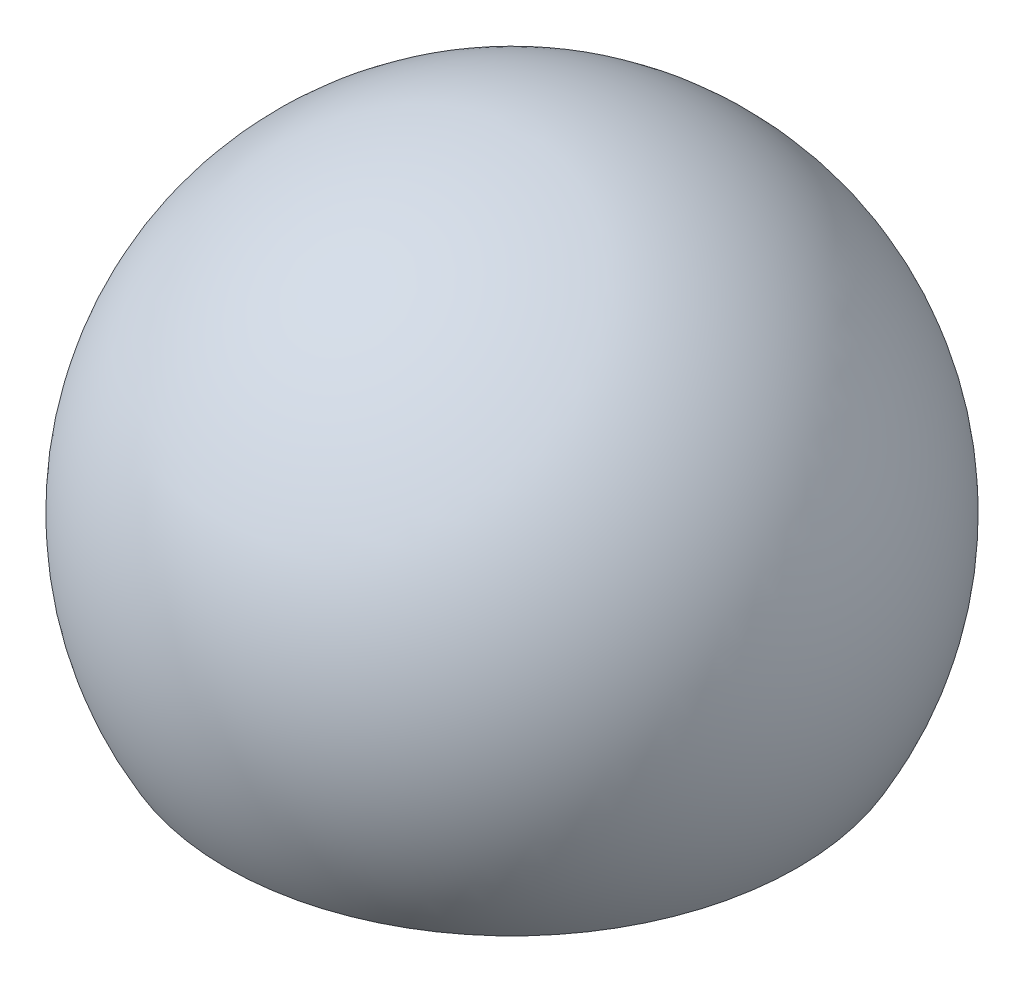
ISO-10303-21;
HEADER;
FILE_DESCRIPTION(('STEP AP214'),'2;1');
FILE_NAME('part.step','',(''),(''),'','','');
FILE_SCHEMA(('AUTOMOTIVE_DESIGN { 1 0 10303 214 1 1 1 1 }'));
ENDSEC;
DATA;
#1=APPLICATION_CONTEXT('core data for automotive mechanical design processes');
#2=APPLICATION_PROTOCOL_DEFINITION('international standard','automotive_design',2000,#1);
#3=PRODUCT_CONTEXT('',#1,'mechanical');
#4=PRODUCT('Part','Part','',(#3));
#5=PRODUCT_RELATED_PRODUCT_CATEGORY('part','',(#4));
#6=PRODUCT_DEFINITION_FORMATION('','',#4);
#7=PRODUCT_DEFINITION_CONTEXT('part definition',#1,'design');
#8=PRODUCT_DEFINITION('design','',#6,#7);
#9=PRODUCT_DEFINITION_SHAPE('','',#8);
#10=(LENGTH_UNIT() NAMED_UNIT(*) SI_UNIT(.MILLI.,.METRE.));
#11=(NAMED_UNIT(*) PLANE_ANGLE_UNIT() SI_UNIT($,.RADIAN.));
#12=(NAMED_UNIT(*) SI_UNIT($,.STERADIAN.) SOLID_ANGLE_UNIT());
#13=UNCERTAINTY_MEASURE_WITH_UNIT(LENGTH_MEASURE(1.E-05),#10,'distance_accuracy_value','');
#14=(GEOMETRIC_REPRESENTATION_CONTEXT(3) GLOBAL_UNCERTAINTY_ASSIGNED_CONTEXT((#13)) GLOBAL_UNIT_ASSIGNED_CONTEXT((#10,
#11,#12)) REPRESENTATION_CONTEXT('',''));
#15=CARTESIAN_POINT('',(0.,0.,0.));
#16=DIRECTION('',(0.,0.,1.));
#17=DIRECTION('',(1.,0.,0.));
#18=AXIS2_PLACEMENT_3D('',#15,#16,#17);
#19=CARTESIAN_POINT('',(0.,0.,0.));
#20=DIRECTION('',(0.,1.,0.));
#21=DIRECTION('',(1.,0.,0.));
#22=AXIS2_PLACEMENT_3D('',#19,#20,#21);
#23=SPHERICAL_SURFACE('',#22,12.7);
#24=CARTESIAN_POINT('',(0.,-6.35,0.));
#25=DIRECTION('',(0.,1.,0.));
#26=DIRECTION('',(0.,0.,1.));
#27=AXIS2_PLACEMENT_3D('',#24,#25,#26);
#28=CIRCLE('',#27,10.9985226280624);
#29=CARTESIAN_POINT('',(0.,-6.35,10.9985226280624));
#30=VERTEX_POINT('',#29);
#31=EDGE_CURVE('E12',#30,#30,#28,.T.);
#32=ORIENTED_EDGE('',*,*,#31,.T.);
#33=EDGE_LOOP('',(#32));
#34=FACE_BOUND('',#33,.T.);
#35=ADVANCED_FACE('F42',(#34),#23,.T.);
#36=CARTESIAN_POINT('',(-10.9985226280624,-6.35,-12.7));
#37=DIRECTION('',(0.,1.,0.));
#38=DIRECTION('',(0.,0.,1.));
#39=AXIS2_PLACEMENT_3D('',#36,#37,#38);
#40=PLANE('',#39);
#41=CARTESIAN_POINT('',(0.,-6.35,0.));
#42=DIRECTION('',(0.,-1.,0.));
#43=DIRECTION('',(0.,0.,-1.));
#44=AXIS2_PLACEMENT_3D('',#41,#42,#43);
#45=CIRCLE('',#44,8.4582);
#46=CARTESIAN_POINT('',(0.,-6.35,-8.4582));
#47=VERTEX_POINT('',#46);
#48=EDGE_CURVE('E52',#47,#47,#45,.T.);
#49=ORIENTED_EDGE('',*,*,#48,.F.);
#50=EDGE_LOOP('',(#49));
#51=FACE_BOUND('',#50,.T.);
#52=ORIENTED_EDGE('',*,*,#31,.F.);
#53=EDGE_LOOP('',(#52));
#54=FACE_BOUND('',#53,.T.);
#55=ADVANCED_FACE('F61',(#51,#54),#40,.F.);
#56=CARTESIAN_POINT('',(0.,-6.223,0.));
#57=DIRECTION('',(0.,-1.,0.));
#58=DIRECTION('',(0.,0.,-1.));
#59=AXIS2_PLACEMENT_3D('',#56,#57,#58);
#60=CYLINDRICAL_SURFACE('',#59,8.4582);
#61=CARTESIAN_POINT('',(0.,-6.223,0.));
#62=DIRECTION('',(0.,-1.,0.));
#63=DIRECTION('',(0.,0.,-1.));
#64=AXIS2_PLACEMENT_3D('',#61,#62,#63);
#65=CIRCLE('',#64,8.4582);
#66=CARTESIAN_POINT('',(0.,-6.223,-8.4582));
#67=VERTEX_POINT('',#66);
#68=EDGE_CURVE('E48',#67,#67,#65,.T.);
#69=ORIENTED_EDGE('',*,*,#68,.F.);
#70=EDGE_LOOP('',(#69));
#71=FACE_BOUND('',#70,.T.);
#72=ORIENTED_EDGE('',*,*,#48,.T.);
#73=EDGE_LOOP('',(#72));
#74=FACE_BOUND('',#73,.T.);
#75=ADVANCED_FACE('F59',(#71,#74),#60,.F.);
#76=CARTESIAN_POINT('',(0.,-6.223,0.));
#77=DIRECTION('',(0.,-1.,0.));
#78=DIRECTION('',(0.,0.,-1.));
#79=AXIS2_PLACEMENT_3D('',#76,#77,#78);
#80=PLANE('',#79);
#81=ORIENTED_EDGE('',*,*,#68,.T.);
#82=EDGE_LOOP('',(#81));
#83=FACE_BOUND('',#82,.T.);
#84=ADVANCED_FACE('F68',(#83),#80,.T.);
#85=CLOSED_SHELL('',(#35,#55,#75,#84));
#86=MANIFOLD_SOLID_BREP('B2',#85);
#87=ADVANCED_BREP_SHAPE_REPRESENTATION('',(#18,#86),#14);
#88=SHAPE_DEFINITION_REPRESENTATION(#9,#87);
ENDSEC;
END-ISO-10303-21;
